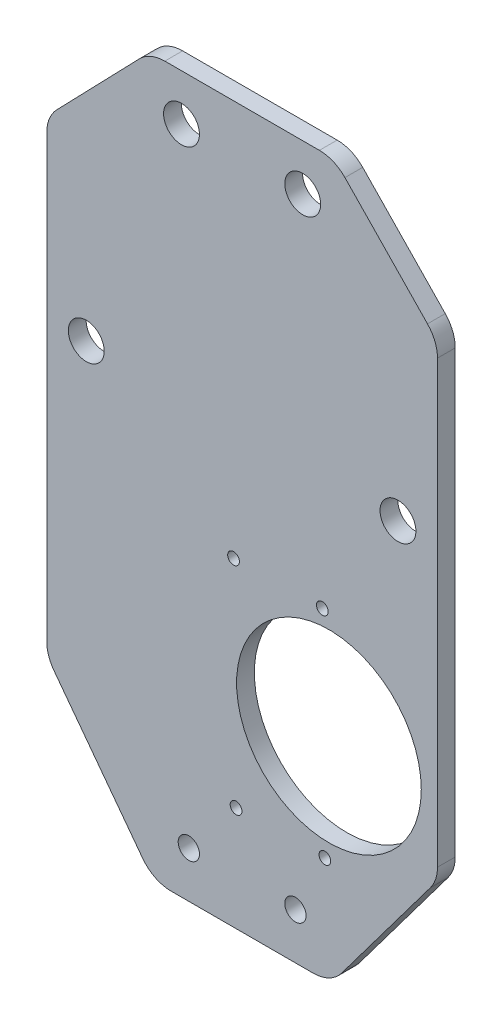
ISO-10303-21;
HEADER;
FILE_DESCRIPTION(('STEP AP214'),'2;1');
FILE_NAME('part.step','',(''),(''),'','','');
FILE_SCHEMA(('AUTOMOTIVE_DESIGN { 1 0 10303 214 1 1 1 1 }'));
ENDSEC;
DATA;
#1=APPLICATION_CONTEXT('core data for automotive mechanical design processes');
#2=APPLICATION_PROTOCOL_DEFINITION('international standard','automotive_design',2000,#1);
#3=PRODUCT_CONTEXT('',#1,'mechanical');
#4=PRODUCT('Part','Part','',(#3));
#5=PRODUCT_RELATED_PRODUCT_CATEGORY('part','',(#4));
#6=PRODUCT_DEFINITION_FORMATION('','',#4);
#7=PRODUCT_DEFINITION_CONTEXT('part definition',#1,'design');
#8=PRODUCT_DEFINITION('design','',#6,#7);
#9=PRODUCT_DEFINITION_SHAPE('','',#8);
#10=(LENGTH_UNIT() NAMED_UNIT(*) SI_UNIT(.MILLI.,.METRE.));
#11=(NAMED_UNIT(*) PLANE_ANGLE_UNIT() SI_UNIT($,.RADIAN.));
#12=(NAMED_UNIT(*) SI_UNIT($,.STERADIAN.) SOLID_ANGLE_UNIT());
#13=UNCERTAINTY_MEASURE_WITH_UNIT(LENGTH_MEASURE(1.E-05),#10,'distance_accuracy_value','');
#14=(GEOMETRIC_REPRESENTATION_CONTEXT(3) GLOBAL_UNCERTAINTY_ASSIGNED_CONTEXT((#13)) GLOBAL_UNIT_ASSIGNED_CONTEXT((#10,
#11,#12)) REPRESENTATION_CONTEXT('',''));
#15=CARTESIAN_POINT('',(0.,0.,0.));
#16=DIRECTION('',(0.,0.,1.));
#17=DIRECTION('',(1.,0.,0.));
#18=AXIS2_PLACEMENT_3D('',#15,#16,#17);
#19=CARTESIAN_POINT('',(0.,0.,5.));
#20=DIRECTION('',(0.,0.,-1.));
#21=DIRECTION('',(-1.,0.,0.));
#22=AXIS2_PLACEMENT_3D('',#19,#20,#21);
#23=PLANE('',#22);
#24=CARTESIAN_POINT('',(-2.41313466629951,89.9378950024155,5.));
#25=DIRECTION('',(0.,0.,-1.));
#26=DIRECTION('',(-1.,0.,0.));
#27=AXIS2_PLACEMENT_3D('',#24,#25,#26);
#28=CIRCLE('',#27,1.65);
#29=CARTESIAN_POINT('',(-4.06313466629951,89.9378950024155,5.));
#30=VERTEX_POINT('',#29);
#31=EDGE_CURVE('E361',#30,#30,#28,.T.);
#32=ORIENTED_EDGE('',*,*,#31,.T.);
#33=EDGE_LOOP('',(#32));
#34=FACE_BOUND('',#33,.T.);
#35=CARTESIAN_POINT('',(22.5851543193509,90.230380540361,5.));
#36=DIRECTION('',(0.,0.,-1.));
#37=DIRECTION('',(-1.,0.,0.));
#38=AXIS2_PLACEMENT_3D('',#35,#36,#37);
#39=CIRCLE('',#38,1.65);
#40=CARTESIAN_POINT('',(20.9351543193509,90.230380540361,5.));
#41=VERTEX_POINT('',#40);
#42=EDGE_CURVE('E355',#41,#41,#39,.T.);
#43=ORIENTED_EDGE('',*,*,#42,.T.);
#44=EDGE_LOOP('',(#43));
#45=FACE_BOUND('',#44,.T.);
#46=CARTESIAN_POINT('',(-1.70531966447117,29.442035657136,5.));
#47=DIRECTION('',(0.,0.,-1.));
#48=DIRECTION('',(-1.,0.,0.));
#49=AXIS2_PLACEMENT_3D('',#46,#47,#48);
#50=CIRCLE('',#49,1.65);
#51=CARTESIAN_POINT('',(-3.35531966447117,29.442035657136,5.));
#52=VERTEX_POINT('',#51);
#53=EDGE_CURVE('E349',#52,#52,#50,.T.);
#54=ORIENTED_EDGE('',*,*,#53,.T.);
#55=EDGE_LOOP('',(#54));
#56=FACE_BOUND('',#55,.T.);
#57=CARTESIAN_POINT('',(23.2929693211793,29.7345211950816,5.));
#58=DIRECTION('',(0.,0.,-1.));
#59=DIRECTION('',(-1.,0.,0.));
#60=AXIS2_PLACEMENT_3D('',#57,#58,#59);
#61=CIRCLE('',#60,1.65);
#62=CARTESIAN_POINT('',(21.6429693211793,29.7345211950816,5.));
#63=VERTEX_POINT('',#62);
#64=EDGE_CURVE('E341',#63,#63,#61,.T.);
#65=ORIENTED_EDGE('',*,*,#64,.T.);
#66=EDGE_LOOP('',(#65));
#67=FACE_BOUND('',#66,.T.);
#68=DIRECTION('',(1.,0.,0.));
#69=VECTOR('',#68,1.);
#70=CARTESIAN_POINT('',(-25.,0.,5.));
#71=LINE('',#70,#69);
#72=CARTESIAN_POINT('',(-20.,0.,5.));
#73=VERTEX_POINT('',#72);
#74=CARTESIAN_POINT('',(20.,0.,5.));
#75=VERTEX_POINT('',#74);
#76=EDGE_CURVE('E286',#73,#75,#71,.T.);
#77=ORIENTED_EDGE('',*,*,#76,.T.);
#78=CARTESIAN_POINT('',(20.,10.,5.));
#79=DIRECTION('',(0.,0.,-1.));
#80=DIRECTION('',(-1.,0.,0.));
#81=AXIS2_PLACEMENT_3D('',#78,#79,#80);
#82=CIRCLE('',#81,10.);
#83=CARTESIAN_POINT('',(28.,4.,5.));
#84=VERTEX_POINT('',#83);
#85=EDGE_CURVE('E231',#75,#84,#82,.F.);
#86=ORIENTED_EDGE('',*,*,#85,.T.);
#87=DIRECTION('',(0.6,0.8,0.));
#88=VECTOR('',#87,1.);
#89=CARTESIAN_POINT('',(25.,0.,5.));
#90=LINE('',#89,#88);
#91=CARTESIAN_POINT('',(53.,37.3333333333333,5.));
#92=VERTEX_POINT('',#91);
#93=EDGE_CURVE('E173',#84,#92,#90,.T.);
#94=ORIENTED_EDGE('',*,*,#93,.T.);
#95=CARTESIAN_POINT('',(45.,43.3333333333333,5.));
#96=DIRECTION('',(0.,0.,-1.));
#97=DIRECTION('',(-1.,0.,0.));
#98=AXIS2_PLACEMENT_3D('',#95,#96,#97);
#99=CIRCLE('',#98,10.);
#100=CARTESIAN_POINT('',(55.,43.3333333333333,5.));
#101=VERTEX_POINT('',#100);
#102=EDGE_CURVE('E229',#92,#101,#99,.F.);
#103=ORIENTED_EDGE('',*,*,#102,.T.);
#104=DIRECTION('',(0.,1.,0.));
#105=VECTOR('',#104,1.);
#106=CARTESIAN_POINT('',(55.,40.,5.));
#107=LINE('',#106,#105);
#108=CARTESIAN_POINT('',(55.,167.456795831017,5.));
#109=VERTEX_POINT('',#108);
#110=EDGE_CURVE('E294',#101,#109,#107,.T.);
#111=ORIENTED_EDGE('',*,*,#110,.T.);
#112=CARTESIAN_POINT('',(45.,167.456795831017,5.));
#113=DIRECTION('',(0.,0.,-1.));
#114=DIRECTION('',(-1.,0.,0.));
#115=AXIS2_PLACEMENT_3D('',#112,#113,#114);
#116=CIRCLE('',#115,10.);
#117=CARTESIAN_POINT('',(52.1898837604911,174.407016799492,5.));
#118=VERTEX_POINT('',#117);
#119=EDGE_CURVE('E218',#109,#118,#116,.F.);
#120=ORIENTED_EDGE('',*,*,#119,.T.);
#121=DIRECTION('',(-0.695022096847475,0.718988376049112,0.));
#122=VECTOR('',#121,1.);
#123=CARTESIAN_POINT('',(55.,171.5,5.));
#124=LINE('',#123,#122);
#125=CARTESIAN_POINT('',(28.9481197304744,198.450220968475,5.));
#126=VERTEX_POINT('',#125);
#127=EDGE_CURVE('E297',#118,#126,#124,.T.);
#128=ORIENTED_EDGE('',*,*,#127,.T.);
#129=CARTESIAN_POINT('',(21.7582359699833,191.5,5.));
#130=DIRECTION('',(0.,0.,-1.));
#131=DIRECTION('',(-1.,0.,0.));
#132=AXIS2_PLACEMENT_3D('',#129,#130,#131);
#133=CIRCLE('',#132,10.);
#134=CARTESIAN_POINT('',(21.7582359699833,201.5,5.));
#135=VERTEX_POINT('',#134);
#136=EDGE_CURVE('E223',#126,#135,#133,.F.);
#137=ORIENTED_EDGE('',*,*,#136,.T.);
#138=DIRECTION('',(-1.,0.,0.));
#139=VECTOR('',#138,1.);
#140=CARTESIAN_POINT('',(-26.,201.5,5.));
#141=LINE('',#140,#139);
#142=CARTESIAN_POINT('',(-21.7582359699833,201.5,5.));
#143=VERTEX_POINT('',#142);
#144=EDGE_CURVE('E268',#135,#143,#141,.T.);
#145=ORIENTED_EDGE('',*,*,#144,.T.);
#146=CARTESIAN_POINT('',(-21.7582359699833,191.5,5.));
#147=DIRECTION('',(0.,0.,-1.));
#148=DIRECTION('',(-1.,0.,0.));
#149=AXIS2_PLACEMENT_3D('',#146,#147,#148);
#150=CIRCLE('',#149,10.);
#151=CARTESIAN_POINT('',(-28.9481197304744,198.450220968475,5.));
#152=VERTEX_POINT('',#151);
#153=EDGE_CURVE('E221',#143,#152,#150,.F.);
#154=ORIENTED_EDGE('',*,*,#153,.T.);
#155=DIRECTION('',(-0.695022096847475,-0.718988376049112,0.));
#156=VECTOR('',#155,1.);
#157=CARTESIAN_POINT('',(-55.,171.5,5.));
#158=LINE('',#157,#156);
#159=CARTESIAN_POINT('',(-52.1898837604911,174.407016799492,5.));
#160=VERTEX_POINT('',#159);
#161=EDGE_CURVE('E260',#152,#160,#158,.T.);
#162=ORIENTED_EDGE('',*,*,#161,.T.);
#163=CARTESIAN_POINT('',(-45.,167.456795831017,5.));
#164=DIRECTION('',(0.,0.,-1.));
#165=DIRECTION('',(-1.,0.,0.));
#166=AXIS2_PLACEMENT_3D('',#163,#164,#165);
#167=CIRCLE('',#166,10.);
#168=CARTESIAN_POINT('',(-55.,167.456795831017,5.));
#169=VERTEX_POINT('',#168);
#170=EDGE_CURVE('E60',#160,#169,#167,.F.);
#171=ORIENTED_EDGE('',*,*,#170,.T.);
#172=DIRECTION('',(0.,-1.,0.));
#173=VECTOR('',#172,1.);
#174=CARTESIAN_POINT('',(-55.,40.,5.));
#175=LINE('',#174,#173);
#176=CARTESIAN_POINT('',(-55.,43.3333333333333,5.));
#177=VERTEX_POINT('',#176);
#178=EDGE_CURVE('E201',#169,#177,#175,.T.);
#179=ORIENTED_EDGE('',*,*,#178,.T.);
#180=CARTESIAN_POINT('',(-45.,43.3333333333333,5.));
#181=DIRECTION('',(0.,0.,-1.));
#182=DIRECTION('',(-1.,0.,0.));
#183=AXIS2_PLACEMENT_3D('',#180,#181,#182);
#184=CIRCLE('',#183,10.);
#185=CARTESIAN_POINT('',(-53.,37.3333333333333,5.));
#186=VERTEX_POINT('',#185);
#187=EDGE_CURVE('E225',#177,#186,#184,.F.);
#188=ORIENTED_EDGE('',*,*,#187,.T.);
#189=DIRECTION('',(0.6,-0.8,0.));
#190=VECTOR('',#189,1.);
#191=CARTESIAN_POINT('',(-25.,0.,5.));
#192=LINE('',#191,#190);
#193=CARTESIAN_POINT('',(-28.,4.,5.));
#194=VERTEX_POINT('',#193);
#195=EDGE_CURVE('E200',#186,#194,#192,.T.);
#196=ORIENTED_EDGE('',*,*,#195,.T.);
#197=CARTESIAN_POINT('',(-20.,10.,5.));
#198=DIRECTION('',(0.,0.,-1.));
#199=DIRECTION('',(-1.,0.,0.));
#200=AXIS2_PLACEMENT_3D('',#197,#198,#199);
#201=CIRCLE('',#200,10.);
#202=EDGE_CURVE('E227',#194,#73,#201,.F.);
#203=ORIENTED_EDGE('',*,*,#202,.T.);
#204=EDGE_LOOP('',(#77,#86,#94,#103,#111,#120,#128,#137,#145,#154,#162,#171,#179,#188,#196,#203));
#205=FACE_BOUND('',#204,.T.);
#206=CARTESIAN_POINT('',(24.4389591594042,60.,5.));
#207=DIRECTION('',(0.,0.,1.));
#208=DIRECTION('',(1.,0.,0.));
#209=AXIS2_PLACEMENT_3D('',#206,#207,#208);
#210=CIRCLE('',#209,26.);
#211=CARTESIAN_POINT('',(50.4389591594041,60.,5.));
#212=VERTEX_POINT('',#211);
#213=EDGE_CURVE('E301',#212,#212,#210,.T.);
#214=ORIENTED_EDGE('',*,*,#213,.F.);
#215=EDGE_LOOP('',(#214));
#216=FACE_BOUND('',#215,.T.);
#217=CARTESIAN_POINT('',(15.,13.,5.));
#218=DIRECTION('',(0.,0.,1.));
#219=DIRECTION('',(1.,0.,0.));
#220=AXIS2_PLACEMENT_3D('',#217,#218,#219);
#221=CIRCLE('',#220,3.);
#222=CARTESIAN_POINT('',(18.,13.,5.));
#223=VERTEX_POINT('',#222);
#224=EDGE_CURVE('E306',#223,#223,#221,.T.);
#225=ORIENTED_EDGE('',*,*,#224,.F.);
#226=EDGE_LOOP('',(#225));
#227=FACE_BOUND('',#226,.T.);
#228=CARTESIAN_POINT('',(-15.,13.,5.));
#229=DIRECTION('',(0.,0.,1.));
#230=DIRECTION('',(-1.,0.,0.));
#231=AXIS2_PLACEMENT_3D('',#228,#229,#230);
#232=CIRCLE('',#231,3.);
#233=CARTESIAN_POINT('',(-18.,13.,5.));
#234=VERTEX_POINT('',#233);
#235=EDGE_CURVE('E311',#234,#234,#232,.T.);
#236=ORIENTED_EDGE('',*,*,#235,.F.);
#237=EDGE_LOOP('',(#236));
#238=FACE_BOUND('',#237,.T.);
#239=CARTESIAN_POINT('',(-17.0625,188.499544235581,5.));
#240=DIRECTION('',(0.,0.,1.));
#241=DIRECTION('',(1.,0.,0.));
#242=AXIS2_PLACEMENT_3D('',#239,#240,#241);
#243=CIRCLE('',#242,5.05);
#244=CARTESIAN_POINT('',(-12.0125,188.499544235581,5.));
#245=VERTEX_POINT('',#244);
#246=EDGE_CURVE('E317',#245,#245,#243,.T.);
#247=ORIENTED_EDGE('',*,*,#246,.F.);
#248=EDGE_LOOP('',(#247));
#249=FACE_BOUND('',#248,.T.);
#250=CARTESIAN_POINT('',(17.0625,188.499544235581,5.));
#251=DIRECTION('',(0.,0.,1.));
#252=DIRECTION('',(1.,0.,0.));
#253=AXIS2_PLACEMENT_3D('',#250,#251,#252);
#254=CIRCLE('',#253,5.05);
#255=CARTESIAN_POINT('',(22.1125,188.499544235581,5.));
#256=VERTEX_POINT('',#255);
#257=EDGE_CURVE('E323',#256,#256,#254,.T.);
#258=ORIENTED_EDGE('',*,*,#257,.F.);
#259=EDGE_LOOP('',(#258));
#260=FACE_BOUND('',#259,.T.);
#261=CARTESIAN_POINT('',(-43.875,122.217270257164,5.));
#262=DIRECTION('',(0.,0.,1.));
#263=DIRECTION('',(1.,0.,0.));
#264=AXIS2_PLACEMENT_3D('',#261,#262,#263);
#265=CIRCLE('',#264,5.05);
#266=CARTESIAN_POINT('',(-38.825,122.217270257164,5.));
#267=VERTEX_POINT('',#266);
#268=EDGE_CURVE('E329',#267,#267,#265,.T.);
#269=ORIENTED_EDGE('',*,*,#268,.F.);
#270=EDGE_LOOP('',(#269));
#271=FACE_BOUND('',#270,.T.);
#272=CARTESIAN_POINT('',(43.875,122.217270257164,5.));
#273=DIRECTION('',(0.,0.,1.));
#274=DIRECTION('',(1.,0.,0.));
#275=AXIS2_PLACEMENT_3D('',#272,#273,#274);
#276=CIRCLE('',#275,5.05);
#277=CARTESIAN_POINT('',(48.925,122.217270257164,5.));
#278=VERTEX_POINT('',#277);
#279=EDGE_CURVE('E335',#278,#278,#276,.T.);
#280=ORIENTED_EDGE('',*,*,#279,.F.);
#281=EDGE_LOOP('',(#280));
#282=FACE_BOUND('',#281,.T.);
#283=ADVANCED_FACE('F38',(#34,#45,#56,#67,#205,#216,#227,#238,#249,#260,#271,#282),#23,.F.);
#284=CARTESIAN_POINT('',(0.,0.,0.));
#285=DIRECTION('',(0.,0.,-1.));
#286=DIRECTION('',(-1.,0.,0.));
#287=AXIS2_PLACEMENT_3D('',#284,#285,#286);
#288=PLANE('',#287);
#289=CARTESIAN_POINT('',(-2.41313466629951,89.9378950024155,0.));
#290=DIRECTION('',(0.,0.,-1.));
#291=DIRECTION('',(-1.,0.,0.));
#292=AXIS2_PLACEMENT_3D('',#289,#290,#291);
#293=CIRCLE('',#292,1.65);
#294=CARTESIAN_POINT('',(-4.06313466629951,89.9378950024155,0.));
#295=VERTEX_POINT('',#294);
#296=EDGE_CURVE('E364',#295,#295,#293,.T.);
#297=ORIENTED_EDGE('',*,*,#296,.F.);
#298=EDGE_LOOP('',(#297));
#299=FACE_BOUND('',#298,.T.);
#300=CARTESIAN_POINT('',(22.5851543193509,90.230380540361,0.));
#301=DIRECTION('',(0.,0.,-1.));
#302=DIRECTION('',(-1.,0.,0.));
#303=AXIS2_PLACEMENT_3D('',#300,#301,#302);
#304=CIRCLE('',#303,1.65);
#305=CARTESIAN_POINT('',(20.9351543193509,90.230380540361,0.));
#306=VERTEX_POINT('',#305);
#307=EDGE_CURVE('E358',#306,#306,#304,.T.);
#308=ORIENTED_EDGE('',*,*,#307,.F.);
#309=EDGE_LOOP('',(#308));
#310=FACE_BOUND('',#309,.T.);
#311=CARTESIAN_POINT('',(-1.70531966447117,29.442035657136,0.));
#312=DIRECTION('',(0.,0.,-1.));
#313=DIRECTION('',(-1.,0.,0.));
#314=AXIS2_PLACEMENT_3D('',#311,#312,#313);
#315=CIRCLE('',#314,1.65);
#316=CARTESIAN_POINT('',(-3.35531966447117,29.442035657136,0.));
#317=VERTEX_POINT('',#316);
#318=EDGE_CURVE('E352',#317,#317,#315,.T.);
#319=ORIENTED_EDGE('',*,*,#318,.F.);
#320=EDGE_LOOP('',(#319));
#321=FACE_BOUND('',#320,.T.);
#322=CARTESIAN_POINT('',(23.2929693211793,29.7345211950816,0.));
#323=DIRECTION('',(0.,0.,-1.));
#324=DIRECTION('',(-1.,0.,0.));
#325=AXIS2_PLACEMENT_3D('',#322,#323,#324);
#326=CIRCLE('',#325,1.65);
#327=CARTESIAN_POINT('',(21.6429693211793,29.7345211950816,0.));
#328=VERTEX_POINT('',#327);
#329=EDGE_CURVE('E346',#328,#328,#326,.T.);
#330=ORIENTED_EDGE('',*,*,#329,.F.);
#331=EDGE_LOOP('',(#330));
#332=FACE_BOUND('',#331,.T.);
#333=CARTESIAN_POINT('',(-43.875,122.217270257164,0.));
#334=DIRECTION('',(0.,0.,1.));
#335=DIRECTION('',(1.,0.,0.));
#336=AXIS2_PLACEMENT_3D('',#333,#334,#335);
#337=CIRCLE('',#336,5.05);
#338=CARTESIAN_POINT('',(-38.825,122.217270257164,0.));
#339=VERTEX_POINT('',#338);
#340=EDGE_CURVE('E332',#339,#339,#337,.T.);
#341=ORIENTED_EDGE('',*,*,#340,.T.);
#342=EDGE_LOOP('',(#341));
#343=FACE_BOUND('',#342,.T.);
#344=CARTESIAN_POINT('',(-17.0625,188.499544235581,0.));
#345=DIRECTION('',(0.,0.,1.));
#346=DIRECTION('',(1.,0.,0.));
#347=AXIS2_PLACEMENT_3D('',#344,#345,#346);
#348=CIRCLE('',#347,5.05);
#349=CARTESIAN_POINT('',(-12.0125,188.499544235581,0.));
#350=VERTEX_POINT('',#349);
#351=EDGE_CURVE('E320',#350,#350,#348,.T.);
#352=ORIENTED_EDGE('',*,*,#351,.T.);
#353=EDGE_LOOP('',(#352));
#354=FACE_BOUND('',#353,.T.);
#355=CARTESIAN_POINT('',(15.,13.,0.));
#356=DIRECTION('',(0.,0.,1.));
#357=DIRECTION('',(1.,0.,0.));
#358=AXIS2_PLACEMENT_3D('',#355,#356,#357);
#359=CIRCLE('',#358,3.);
#360=CARTESIAN_POINT('',(18.,13.,0.));
#361=VERTEX_POINT('',#360);
#362=EDGE_CURVE('E308',#361,#361,#359,.T.);
#363=ORIENTED_EDGE('',*,*,#362,.T.);
#364=EDGE_LOOP('',(#363));
#365=FACE_BOUND('',#364,.T.);
#366=DIRECTION('',(0.6,0.8,0.));
#367=VECTOR('',#366,1.);
#368=CARTESIAN_POINT('',(25.,0.,0.));
#369=LINE('',#368,#367);
#370=CARTESIAN_POINT('',(28.,4.,0.));
#371=VERTEX_POINT('',#370);
#372=CARTESIAN_POINT('',(53.,37.3333333333333,0.));
#373=VERTEX_POINT('',#372);
#374=EDGE_CURVE('E170',#371,#373,#369,.T.);
#375=ORIENTED_EDGE('',*,*,#374,.F.);
#376=CARTESIAN_POINT('',(20.,10.,0.));
#377=DIRECTION('',(0.,0.,-1.));
#378=DIRECTION('',(-1.,0.,0.));
#379=AXIS2_PLACEMENT_3D('',#376,#377,#378);
#380=CIRCLE('',#379,10.);
#381=CARTESIAN_POINT('',(20.,0.,0.));
#382=VERTEX_POINT('',#381);
#383=EDGE_CURVE('E153',#371,#382,#380,.T.);
#384=ORIENTED_EDGE('',*,*,#383,.T.);
#385=DIRECTION('',(1.,0.,0.));
#386=VECTOR('',#385,1.);
#387=CARTESIAN_POINT('',(-25.,0.,0.));
#388=LINE('',#387,#386);
#389=CARTESIAN_POINT('',(-20.,0.,0.));
#390=VERTEX_POINT('',#389);
#391=EDGE_CURVE('E181',#390,#382,#388,.T.);
#392=ORIENTED_EDGE('',*,*,#391,.F.);
#393=CARTESIAN_POINT('',(-20.,10.,0.));
#394=DIRECTION('',(0.,0.,-1.));
#395=DIRECTION('',(-1.,0.,0.));
#396=AXIS2_PLACEMENT_3D('',#393,#394,#395);
#397=CIRCLE('',#396,10.);
#398=CARTESIAN_POINT('',(-28.,4.,0.));
#399=VERTEX_POINT('',#398);
#400=EDGE_CURVE('E212',#390,#399,#397,.T.);
#401=ORIENTED_EDGE('',*,*,#400,.T.);
#402=DIRECTION('',(0.6,-0.8,0.));
#403=VECTOR('',#402,1.);
#404=CARTESIAN_POINT('',(-25.,0.,0.));
#405=LINE('',#404,#403);
#406=CARTESIAN_POINT('',(-53.,37.3333333333333,0.));
#407=VERTEX_POINT('',#406);
#408=EDGE_CURVE('E186',#407,#399,#405,.T.);
#409=ORIENTED_EDGE('',*,*,#408,.F.);
#410=CARTESIAN_POINT('',(-45.,43.3333333333333,0.));
#411=DIRECTION('',(0.,0.,-1.));
#412=DIRECTION('',(-1.,0.,0.));
#413=AXIS2_PLACEMENT_3D('',#410,#411,#412);
#414=CIRCLE('',#413,10.);
#415=CARTESIAN_POINT('',(-55.,43.3333333333333,0.));
#416=VERTEX_POINT('',#415);
#417=EDGE_CURVE('E210',#407,#416,#414,.T.);
#418=ORIENTED_EDGE('',*,*,#417,.T.);
#419=DIRECTION('',(0.,-1.,0.));
#420=VECTOR('',#419,1.);
#421=CARTESIAN_POINT('',(-55.,40.,0.));
#422=LINE('',#421,#420);
#423=CARTESIAN_POINT('',(-55.,167.456795831017,0.));
#424=VERTEX_POINT('',#423);
#425=EDGE_CURVE('E198',#424,#416,#422,.T.);
#426=ORIENTED_EDGE('',*,*,#425,.F.);
#427=CARTESIAN_POINT('',(-45.,167.456795831017,0.));
#428=DIRECTION('',(0.,0.,-1.));
#429=DIRECTION('',(-1.,0.,0.));
#430=AXIS2_PLACEMENT_3D('',#427,#428,#429);
#431=CIRCLE('',#430,10.);
#432=CARTESIAN_POINT('',(-52.1898837604911,174.407016799492,0.));
#433=VERTEX_POINT('',#432);
#434=EDGE_CURVE('E204',#424,#433,#431,.T.);
#435=ORIENTED_EDGE('',*,*,#434,.T.);
#436=DIRECTION('',(-0.695022096847475,-0.718988376049112,0.));
#437=VECTOR('',#436,1.);
#438=CARTESIAN_POINT('',(-55.,171.5,0.));
#439=LINE('',#438,#437);
#440=CARTESIAN_POINT('',(-28.9481197304744,198.450220968475,0.));
#441=VERTEX_POINT('',#440);
#442=EDGE_CURVE('E195',#441,#433,#439,.T.);
#443=ORIENTED_EDGE('',*,*,#442,.F.);
#444=CARTESIAN_POINT('',(-21.7582359699833,191.5,0.));
#445=DIRECTION('',(0.,0.,-1.));
#446=DIRECTION('',(-1.,0.,0.));
#447=AXIS2_PLACEMENT_3D('',#444,#445,#446);
#448=CIRCLE('',#447,10.);
#449=CARTESIAN_POINT('',(-21.7582359699833,201.5,0.));
#450=VERTEX_POINT('',#449);
#451=EDGE_CURVE('E206',#441,#450,#448,.T.);
#452=ORIENTED_EDGE('',*,*,#451,.T.);
#453=DIRECTION('',(-1.,0.,0.));
#454=VECTOR('',#453,1.);
#455=CARTESIAN_POINT('',(-26.,201.5,0.));
#456=LINE('',#455,#454);
#457=CARTESIAN_POINT('',(21.7582359699833,201.5,0.));
#458=VERTEX_POINT('',#457);
#459=EDGE_CURVE('E192',#458,#450,#456,.T.);
#460=ORIENTED_EDGE('',*,*,#459,.F.);
#461=CARTESIAN_POINT('',(21.7582359699833,191.5,0.));
#462=DIRECTION('',(0.,0.,-1.));
#463=DIRECTION('',(-1.,0.,0.));
#464=AXIS2_PLACEMENT_3D('',#461,#462,#463);
#465=CIRCLE('',#464,10.);
#466=CARTESIAN_POINT('',(28.9481197304744,198.450220968475,0.));
#467=VERTEX_POINT('',#466);
#468=EDGE_CURVE('E208',#458,#467,#465,.T.);
#469=ORIENTED_EDGE('',*,*,#468,.T.);
#470=DIRECTION('',(-0.695022096847475,0.718988376049112,0.));
#471=VECTOR('',#470,1.);
#472=CARTESIAN_POINT('',(55.,171.5,0.));
#473=LINE('',#472,#471);
#474=CARTESIAN_POINT('',(52.1898837604911,174.407016799492,0.));
#475=VERTEX_POINT('',#474);
#476=EDGE_CURVE('E184',#475,#467,#473,.T.);
#477=ORIENTED_EDGE('',*,*,#476,.F.);
#478=CARTESIAN_POINT('',(45.,167.456795831017,0.));
#479=DIRECTION('',(0.,0.,-1.));
#480=DIRECTION('',(-1.,0.,0.));
#481=AXIS2_PLACEMENT_3D('',#478,#479,#480);
#482=CIRCLE('',#481,10.);
#483=CARTESIAN_POINT('',(55.,167.456795831017,0.));
#484=VERTEX_POINT('',#483);
#485=EDGE_CURVE('E174',#475,#484,#482,.T.);
#486=ORIENTED_EDGE('',*,*,#485,.T.);
#487=DIRECTION('',(0.,1.,0.));
#488=VECTOR('',#487,1.);
#489=CARTESIAN_POINT('',(55.,40.,0.));
#490=LINE('',#489,#488);
#491=CARTESIAN_POINT('',(55.,43.3333333333333,0.));
#492=VERTEX_POINT('',#491);
#493=EDGE_CURVE('E180',#492,#484,#490,.T.);
#494=ORIENTED_EDGE('',*,*,#493,.F.);
#495=CARTESIAN_POINT('',(45.,43.3333333333333,0.));
#496=DIRECTION('',(0.,0.,-1.));
#497=DIRECTION('',(-1.,0.,0.));
#498=AXIS2_PLACEMENT_3D('',#495,#496,#497);
#499=CIRCLE('',#498,10.);
#500=EDGE_CURVE('E164',#492,#373,#499,.T.);
#501=ORIENTED_EDGE('',*,*,#500,.T.);
#502=EDGE_LOOP('',(#375,#384,#392,#401,#409,#418,#426,#435,#443,#452,#460,#469,#477,#486,#494,#501));
#503=FACE_BOUND('',#502,.T.);
#504=CARTESIAN_POINT('',(24.4389591594042,60.,0.));
#505=DIRECTION('',(0.,0.,1.));
#506=DIRECTION('',(1.,0.,0.));
#507=AXIS2_PLACEMENT_3D('',#504,#505,#506);
#508=CIRCLE('',#507,26.);
#509=CARTESIAN_POINT('',(50.4389591594041,60.,0.));
#510=VERTEX_POINT('',#509);
#511=EDGE_CURVE('E290',#510,#510,#508,.T.);
#512=ORIENTED_EDGE('',*,*,#511,.T.);
#513=EDGE_LOOP('',(#512));
#514=FACE_BOUND('',#513,.T.);
#515=CARTESIAN_POINT('',(-15.,13.,0.));
#516=DIRECTION('',(0.,0.,1.));
#517=DIRECTION('',(-1.,0.,0.));
#518=AXIS2_PLACEMENT_3D('',#515,#516,#517);
#519=CIRCLE('',#518,3.);
#520=CARTESIAN_POINT('',(-18.,13.,0.));
#521=VERTEX_POINT('',#520);
#522=EDGE_CURVE('E314',#521,#521,#519,.T.);
#523=ORIENTED_EDGE('',*,*,#522,.T.);
#524=EDGE_LOOP('',(#523));
#525=FACE_BOUND('',#524,.T.);
#526=CARTESIAN_POINT('',(17.0625,188.499544235581,0.));
#527=DIRECTION('',(0.,0.,1.));
#528=DIRECTION('',(1.,0.,0.));
#529=AXIS2_PLACEMENT_3D('',#526,#527,#528);
#530=CIRCLE('',#529,5.05);
#531=CARTESIAN_POINT('',(22.1125,188.499544235581,0.));
#532=VERTEX_POINT('',#531);
#533=EDGE_CURVE('E326',#532,#532,#530,.T.);
#534=ORIENTED_EDGE('',*,*,#533,.T.);
#535=EDGE_LOOP('',(#534));
#536=FACE_BOUND('',#535,.T.);
#537=CARTESIAN_POINT('',(43.875,122.217270257164,0.));
#538=DIRECTION('',(0.,0.,1.));
#539=DIRECTION('',(1.,0.,0.));
#540=AXIS2_PLACEMENT_3D('',#537,#538,#539);
#541=CIRCLE('',#540,5.05);
#542=CARTESIAN_POINT('',(48.925,122.217270257164,0.));
#543=VERTEX_POINT('',#542);
#544=EDGE_CURVE('E338',#543,#543,#541,.T.);
#545=ORIENTED_EDGE('',*,*,#544,.T.);
#546=EDGE_LOOP('',(#545));
#547=FACE_BOUND('',#546,.T.);
#548=ADVANCED_FACE('F177',(#299,#310,#321,#332,#343,#354,#365,#503,#514,#525,#536,#547),#288,.T.);
#549=CARTESIAN_POINT('',(-25.,0.,5.));
#550=DIRECTION('',(0.8,0.6,0.));
#551=DIRECTION('',(-0.6,0.8,0.));
#552=AXIS2_PLACEMENT_3D('',#549,#550,#551);
#553=PLANE('',#552);
#554=ORIENTED_EDGE('',*,*,#408,.T.);
#555=DIRECTION('',(0.,0.,-1.));
#556=VECTOR('',#555,1.);
#557=CARTESIAN_POINT('',(-28.,4.,5.));
#558=LINE('',#557,#556);
#559=EDGE_CURVE('E241',#399,#194,#558,.F.);
#560=ORIENTED_EDGE('',*,*,#559,.T.);
#561=ORIENTED_EDGE('',*,*,#195,.F.);
#562=DIRECTION('',(0.,0.,-1.));
#563=VECTOR('',#562,1.);
#564=CARTESIAN_POINT('',(-53.,37.3333333333333,5.));
#565=LINE('',#564,#563);
#566=EDGE_CURVE('E238',#186,#407,#565,.T.);
#567=ORIENTED_EDGE('',*,*,#566,.T.);
#568=EDGE_LOOP('',(#554,#560,#561,#567));
#569=FACE_BOUND('',#568,.T.);
#570=ADVANCED_FACE('F282',(#569),#553,.F.);
#571=CARTESIAN_POINT('',(-25.,0.,5.));
#572=DIRECTION('',(0.,1.,0.));
#573=DIRECTION('',(0.,0.,1.));
#574=AXIS2_PLACEMENT_3D('',#571,#572,#573);
#575=PLANE('',#574);
#576=ORIENTED_EDGE('',*,*,#391,.T.);
#577=DIRECTION('',(0.,0.,-1.));
#578=VECTOR('',#577,1.);
#579=CARTESIAN_POINT('',(20.,0.,5.));
#580=LINE('',#579,#578);
#581=EDGE_CURVE('E158',#382,#75,#580,.F.);
#582=ORIENTED_EDGE('',*,*,#581,.T.);
#583=ORIENTED_EDGE('',*,*,#76,.F.);
#584=DIRECTION('',(0.,0.,-1.));
#585=VECTOR('',#584,1.);
#586=CARTESIAN_POINT('',(-20.,0.,5.));
#587=LINE('',#586,#585);
#588=EDGE_CURVE('E163',#73,#390,#587,.T.);
#589=ORIENTED_EDGE('',*,*,#588,.T.);
#590=EDGE_LOOP('',(#576,#582,#583,#589));
#591=FACE_BOUND('',#590,.T.);
#592=ADVANCED_FACE('F425',(#591),#575,.F.);
#593=CARTESIAN_POINT('',(25.,0.,5.));
#594=DIRECTION('',(-0.8,0.6,0.));
#595=DIRECTION('',(-0.6,-0.8,0.));
#596=AXIS2_PLACEMENT_3D('',#593,#594,#595);
#597=PLANE('',#596);
#598=ORIENTED_EDGE('',*,*,#93,.F.);
#599=DIRECTION('',(0.,0.,-1.));
#600=VECTOR('',#599,1.);
#601=CARTESIAN_POINT('',(28.,4.,5.));
#602=LINE('',#601,#600);
#603=EDGE_CURVE('E157',#84,#371,#602,.T.);
#604=ORIENTED_EDGE('',*,*,#603,.T.);
#605=ORIENTED_EDGE('',*,*,#374,.T.);
#606=DIRECTION('',(0.,0.,-1.));
#607=VECTOR('',#606,1.);
#608=CARTESIAN_POINT('',(53.,37.3333333333333,5.));
#609=LINE('',#608,#607);
#610=EDGE_CURVE('E175',#373,#92,#609,.F.);
#611=ORIENTED_EDGE('',*,*,#610,.T.);
#612=EDGE_LOOP('',(#598,#604,#605,#611));
#613=FACE_BOUND('',#612,.T.);
#614=ADVANCED_FACE('F169',(#613),#597,.F.);
#615=CARTESIAN_POINT('',(55.,40.,5.));
#616=DIRECTION('',(-1.,0.,0.));
#617=DIRECTION('',(0.,-1.,0.));
#618=AXIS2_PLACEMENT_3D('',#615,#616,#617);
#619=PLANE('',#618);
#620=ORIENTED_EDGE('',*,*,#110,.F.);
#621=DIRECTION('',(0.,0.,-1.));
#622=VECTOR('',#621,1.);
#623=CARTESIAN_POINT('',(55.,43.3333333333333,5.));
#624=LINE('',#623,#622);
#625=EDGE_CURVE('E235',#101,#492,#624,.T.);
#626=ORIENTED_EDGE('',*,*,#625,.T.);
#627=ORIENTED_EDGE('',*,*,#493,.T.);
#628=DIRECTION('',(0.,0.,-1.));
#629=VECTOR('',#628,1.);
#630=CARTESIAN_POINT('',(55.,167.456795831017,5.));
#631=LINE('',#630,#629);
#632=EDGE_CURVE('E233',#484,#109,#631,.F.);
#633=ORIENTED_EDGE('',*,*,#632,.T.);
#634=EDGE_LOOP('',(#620,#626,#627,#633));
#635=FACE_BOUND('',#634,.T.);
#636=ADVANCED_FACE('F418',(#635),#619,.F.);
#637=CARTESIAN_POINT('',(55.,171.5,5.));
#638=DIRECTION('',(-0.718988376049112,-0.695022096847475,0.));
#639=DIRECTION('',(0.695022096847475,-0.718988376049112,0.));
#640=AXIS2_PLACEMENT_3D('',#637,#638,#639);
#641=PLANE('',#640);
#642=ORIENTED_EDGE('',*,*,#476,.T.);
#643=DIRECTION('',(0.,0.,-1.));
#644=VECTOR('',#643,1.);
#645=CARTESIAN_POINT('',(28.9481197304744,198.450220968475,5.));
#646=LINE('',#645,#644);
#647=EDGE_CURVE('E255',#467,#126,#646,.F.);
#648=ORIENTED_EDGE('',*,*,#647,.T.);
#649=ORIENTED_EDGE('',*,*,#127,.F.);
#650=DIRECTION('',(0.,0.,-1.));
#651=VECTOR('',#650,1.);
#652=CARTESIAN_POINT('',(52.1898837604911,174.407016799492,5.));
#653=LINE('',#652,#651);
#654=EDGE_CURVE('E252',#118,#475,#653,.T.);
#655=ORIENTED_EDGE('',*,*,#654,.T.);
#656=EDGE_LOOP('',(#642,#648,#649,#655));
#657=FACE_BOUND('',#656,.T.);
#658=ADVANCED_FACE('F414',(#657),#641,.F.);
#659=CARTESIAN_POINT('',(-26.,201.5,5.));
#660=DIRECTION('',(0.,-1.,0.));
#661=DIRECTION('',(0.,0.,-1.));
#662=AXIS2_PLACEMENT_3D('',#659,#660,#661);
#663=PLANE('',#662);
#664=ORIENTED_EDGE('',*,*,#144,.F.);
#665=DIRECTION('',(0.,0.,-1.));
#666=VECTOR('',#665,1.);
#667=CARTESIAN_POINT('',(21.7582359699833,201.5,5.));
#668=LINE('',#667,#666);
#669=EDGE_CURVE('E249',#135,#458,#668,.T.);
#670=ORIENTED_EDGE('',*,*,#669,.T.);
#671=ORIENTED_EDGE('',*,*,#459,.T.);
#672=DIRECTION('',(0.,0.,-1.));
#673=VECTOR('',#672,1.);
#674=CARTESIAN_POINT('',(-21.7582359699833,201.5,5.));
#675=LINE('',#674,#673);
#676=EDGE_CURVE('E247',#450,#143,#675,.F.);
#677=ORIENTED_EDGE('',*,*,#676,.T.);
#678=EDGE_LOOP('',(#664,#670,#671,#677));
#679=FACE_BOUND('',#678,.T.);
#680=ADVANCED_FACE('F411',(#679),#663,.F.);
#681=CARTESIAN_POINT('',(-55.,171.5,5.));
#682=DIRECTION('',(0.718988376049112,-0.695022096847475,0.));
#683=DIRECTION('',(0.695022096847475,0.718988376049112,0.));
#684=AXIS2_PLACEMENT_3D('',#681,#682,#683);
#685=PLANE('',#684);
#686=ORIENTED_EDGE('',*,*,#161,.F.);
#687=DIRECTION('',(0.,0.,-1.));
#688=VECTOR('',#687,1.);
#689=CARTESIAN_POINT('',(-28.9481197304744,198.450220968475,5.));
#690=LINE('',#689,#688);
#691=EDGE_CURVE('E11',#152,#441,#690,.T.);
#692=ORIENTED_EDGE('',*,*,#691,.T.);
#693=ORIENTED_EDGE('',*,*,#442,.T.);
#694=DIRECTION('',(0.,0.,-1.));
#695=VECTOR('',#694,1.);
#696=CARTESIAN_POINT('',(-52.1898837604911,174.407016799492,5.));
#697=LINE('',#696,#695);
#698=EDGE_CURVE('E46',#433,#160,#697,.F.);
#699=ORIENTED_EDGE('',*,*,#698,.T.);
#700=EDGE_LOOP('',(#686,#692,#693,#699));
#701=FACE_BOUND('',#700,.T.);
#702=ADVANCED_FACE('F259',(#701),#685,.F.);
#703=CARTESIAN_POINT('',(-55.,40.,5.));
#704=DIRECTION('',(1.,0.,0.));
#705=DIRECTION('',(0.,1.,0.));
#706=AXIS2_PLACEMENT_3D('',#703,#704,#705);
#707=PLANE('',#706);
#708=ORIENTED_EDGE('',*,*,#425,.T.);
#709=DIRECTION('',(0.,0.,-1.));
#710=VECTOR('',#709,1.);
#711=CARTESIAN_POINT('',(-55.,43.3333333333333,5.));
#712=LINE('',#711,#710);
#713=EDGE_CURVE('E53',#416,#177,#712,.F.);
#714=ORIENTED_EDGE('',*,*,#713,.T.);
#715=ORIENTED_EDGE('',*,*,#178,.F.);
#716=DIRECTION('',(0.,0.,-1.));
#717=VECTOR('',#716,1.);
#718=CARTESIAN_POINT('',(-55.,167.456795831017,5.));
#719=LINE('',#718,#717);
#720=EDGE_CURVE('E243',#169,#424,#719,.T.);
#721=ORIENTED_EDGE('',*,*,#720,.T.);
#722=EDGE_LOOP('',(#708,#714,#715,#721));
#723=FACE_BOUND('',#722,.T.);
#724=ADVANCED_FACE('F273',(#723),#707,.F.);
#725=CARTESIAN_POINT('',(24.4389591594042,60.,5.));
#726=DIRECTION('',(0.,0.,-1.));
#727=DIRECTION('',(-1.,0.,0.));
#728=AXIS2_PLACEMENT_3D('',#725,#726,#727);
#729=CYLINDRICAL_SURFACE('',#728,26.);
#730=ORIENTED_EDGE('',*,*,#213,.T.);
#731=EDGE_LOOP('',(#730));
#732=FACE_BOUND('',#731,.T.);
#733=ORIENTED_EDGE('',*,*,#511,.F.);
#734=EDGE_LOOP('',(#733));
#735=FACE_BOUND('',#734,.T.);
#736=ADVANCED_FACE('F389',(#732,#735),#729,.F.);
#737=CARTESIAN_POINT('',(15.,13.,5.));
#738=DIRECTION('',(0.,0.,-1.));
#739=DIRECTION('',(-1.,0.,0.));
#740=AXIS2_PLACEMENT_3D('',#737,#738,#739);
#741=CYLINDRICAL_SURFACE('',#740,3.);
#742=ORIENTED_EDGE('',*,*,#224,.T.);
#743=EDGE_LOOP('',(#742));
#744=FACE_BOUND('',#743,.T.);
#745=ORIENTED_EDGE('',*,*,#362,.F.);
#746=EDGE_LOOP('',(#745));
#747=FACE_BOUND('',#746,.T.);
#748=ADVANCED_FACE('F386',(#744,#747),#741,.F.);
#749=CARTESIAN_POINT('',(-15.,13.,5.));
#750=DIRECTION('',(0.,0.,-1.));
#751=DIRECTION('',(-1.,0.,0.));
#752=AXIS2_PLACEMENT_3D('',#749,#750,#751);
#753=CYLINDRICAL_SURFACE('',#752,3.);
#754=ORIENTED_EDGE('',*,*,#235,.T.);
#755=EDGE_LOOP('',(#754));
#756=FACE_BOUND('',#755,.T.);
#757=ORIENTED_EDGE('',*,*,#522,.F.);
#758=EDGE_LOOP('',(#757));
#759=FACE_BOUND('',#758,.T.);
#760=ADVANCED_FACE('F388',(#756,#759),#753,.F.);
#761=CARTESIAN_POINT('',(-17.0625,188.499544235581,5.));
#762=DIRECTION('',(0.,0.,-1.));
#763=DIRECTION('',(-1.,0.,0.));
#764=AXIS2_PLACEMENT_3D('',#761,#762,#763);
#765=CYLINDRICAL_SURFACE('',#764,5.05);
#766=ORIENTED_EDGE('',*,*,#246,.T.);
#767=EDGE_LOOP('',(#766));
#768=FACE_BOUND('',#767,.T.);
#769=ORIENTED_EDGE('',*,*,#351,.F.);
#770=EDGE_LOOP('',(#769));
#771=FACE_BOUND('',#770,.T.);
#772=ADVANCED_FACE('F396',(#768,#771),#765,.F.);
#773=CARTESIAN_POINT('',(17.0625,188.499544235581,5.));
#774=DIRECTION('',(0.,0.,-1.));
#775=DIRECTION('',(-1.,0.,0.));
#776=AXIS2_PLACEMENT_3D('',#773,#774,#775);
#777=CYLINDRICAL_SURFACE('',#776,5.05);
#778=ORIENTED_EDGE('',*,*,#257,.T.);
#779=EDGE_LOOP('',(#778));
#780=FACE_BOUND('',#779,.T.);
#781=ORIENTED_EDGE('',*,*,#533,.F.);
#782=EDGE_LOOP('',(#781));
#783=FACE_BOUND('',#782,.T.);
#784=ADVANCED_FACE('F494',(#780,#783),#777,.F.);
#785=CARTESIAN_POINT('',(-43.875,122.217270257164,5.));
#786=DIRECTION('',(0.,0.,-1.));
#787=DIRECTION('',(-1.,0.,0.));
#788=AXIS2_PLACEMENT_3D('',#785,#786,#787);
#789=CYLINDRICAL_SURFACE('',#788,5.05);
#790=ORIENTED_EDGE('',*,*,#268,.T.);
#791=EDGE_LOOP('',(#790));
#792=FACE_BOUND('',#791,.T.);
#793=ORIENTED_EDGE('',*,*,#340,.F.);
#794=EDGE_LOOP('',(#793));
#795=FACE_BOUND('',#794,.T.);
#796=ADVANCED_FACE('F490',(#792,#795),#789,.F.);
#797=CARTESIAN_POINT('',(43.875,122.217270257164,5.));
#798=DIRECTION('',(0.,0.,-1.));
#799=DIRECTION('',(-1.,0.,0.));
#800=AXIS2_PLACEMENT_3D('',#797,#798,#799);
#801=CYLINDRICAL_SURFACE('',#800,5.05);
#802=ORIENTED_EDGE('',*,*,#279,.T.);
#803=EDGE_LOOP('',(#802));
#804=FACE_BOUND('',#803,.T.);
#805=ORIENTED_EDGE('',*,*,#544,.F.);
#806=EDGE_LOOP('',(#805));
#807=FACE_BOUND('',#806,.T.);
#808=ADVANCED_FACE('F434',(#804,#807),#801,.F.);
#809=CARTESIAN_POINT('',(20.,10.,5.));
#810=DIRECTION('',(0.,0.,-1.));
#811=DIRECTION('',(-1.,0.,0.));
#812=AXIS2_PLACEMENT_3D('',#809,#810,#811);
#813=CYLINDRICAL_SURFACE('',#812,10.);
#814=ORIENTED_EDGE('',*,*,#85,.F.);
#815=ORIENTED_EDGE('',*,*,#581,.F.);
#816=ORIENTED_EDGE('',*,*,#383,.F.);
#817=ORIENTED_EDGE('',*,*,#603,.F.);
#818=EDGE_LOOP('',(#814,#815,#816,#817));
#819=FACE_BOUND('',#818,.T.);
#820=ADVANCED_FACE('F156',(#819),#813,.T.);
#821=CARTESIAN_POINT('',(45.,43.3333333333333,5.));
#822=DIRECTION('',(0.,0.,-1.));
#823=DIRECTION('',(-1.,0.,0.));
#824=AXIS2_PLACEMENT_3D('',#821,#822,#823);
#825=CYLINDRICAL_SURFACE('',#824,10.);
#826=ORIENTED_EDGE('',*,*,#102,.F.);
#827=ORIENTED_EDGE('',*,*,#610,.F.);
#828=ORIENTED_EDGE('',*,*,#500,.F.);
#829=ORIENTED_EDGE('',*,*,#625,.F.);
#830=EDGE_LOOP('',(#826,#827,#828,#829));
#831=FACE_BOUND('',#830,.T.);
#832=ADVANCED_FACE('F433',(#831),#825,.T.);
#833=CARTESIAN_POINT('',(-20.,10.,5.));
#834=DIRECTION('',(0.,0.,-1.));
#835=DIRECTION('',(-1.,0.,0.));
#836=AXIS2_PLACEMENT_3D('',#833,#834,#835);
#837=CYLINDRICAL_SURFACE('',#836,10.);
#838=ORIENTED_EDGE('',*,*,#202,.F.);
#839=ORIENTED_EDGE('',*,*,#559,.F.);
#840=ORIENTED_EDGE('',*,*,#400,.F.);
#841=ORIENTED_EDGE('',*,*,#588,.F.);
#842=EDGE_LOOP('',(#838,#839,#840,#841));
#843=FACE_BOUND('',#842,.T.);
#844=ADVANCED_FACE('F437',(#843),#837,.T.);
#845=CARTESIAN_POINT('',(-45.,43.3333333333333,5.));
#846=DIRECTION('',(0.,0.,-1.));
#847=DIRECTION('',(-1.,0.,0.));
#848=AXIS2_PLACEMENT_3D('',#845,#846,#847);
#849=CYLINDRICAL_SURFACE('',#848,10.);
#850=ORIENTED_EDGE('',*,*,#187,.F.);
#851=ORIENTED_EDGE('',*,*,#713,.F.);
#852=ORIENTED_EDGE('',*,*,#417,.F.);
#853=ORIENTED_EDGE('',*,*,#566,.F.);
#854=EDGE_LOOP('',(#850,#851,#852,#853));
#855=FACE_BOUND('',#854,.T.);
#856=ADVANCED_FACE('F279',(#855),#849,.T.);
#857=CARTESIAN_POINT('',(21.7582359699833,191.5,5.));
#858=DIRECTION('',(0.,0.,-1.));
#859=DIRECTION('',(-1.,0.,0.));
#860=AXIS2_PLACEMENT_3D('',#857,#858,#859);
#861=CYLINDRICAL_SURFACE('',#860,10.);
#862=ORIENTED_EDGE('',*,*,#136,.F.);
#863=ORIENTED_EDGE('',*,*,#647,.F.);
#864=ORIENTED_EDGE('',*,*,#468,.F.);
#865=ORIENTED_EDGE('',*,*,#669,.F.);
#866=EDGE_LOOP('',(#862,#863,#864,#865));
#867=FACE_BOUND('',#866,.T.);
#868=ADVANCED_FACE('F444',(#867),#861,.T.);
#869=CARTESIAN_POINT('',(-21.7582359699833,191.5,5.));
#870=DIRECTION('',(0.,0.,-1.));
#871=DIRECTION('',(-1.,0.,0.));
#872=AXIS2_PLACEMENT_3D('',#869,#870,#871);
#873=CYLINDRICAL_SURFACE('',#872,10.);
#874=ORIENTED_EDGE('',*,*,#153,.F.);
#875=ORIENTED_EDGE('',*,*,#676,.F.);
#876=ORIENTED_EDGE('',*,*,#451,.F.);
#877=ORIENTED_EDGE('',*,*,#691,.F.);
#878=EDGE_LOOP('',(#874,#875,#876,#877));
#879=FACE_BOUND('',#878,.T.);
#880=ADVANCED_FACE('F447',(#879),#873,.T.);
#881=CARTESIAN_POINT('',(-45.,167.456795831017,5.));
#882=DIRECTION('',(0.,0.,-1.));
#883=DIRECTION('',(-1.,0.,0.));
#884=AXIS2_PLACEMENT_3D('',#881,#882,#883);
#885=CYLINDRICAL_SURFACE('',#884,10.);
#886=ORIENTED_EDGE('',*,*,#170,.F.);
#887=ORIENTED_EDGE('',*,*,#698,.F.);
#888=ORIENTED_EDGE('',*,*,#434,.F.);
#889=ORIENTED_EDGE('',*,*,#720,.F.);
#890=EDGE_LOOP('',(#886,#887,#888,#889));
#891=FACE_BOUND('',#890,.T.);
#892=ADVANCED_FACE('F271',(#891),#885,.T.);
#893=CARTESIAN_POINT('',(45.,167.456795831017,5.));
#894=DIRECTION('',(0.,0.,-1.));
#895=DIRECTION('',(-1.,0.,0.));
#896=AXIS2_PLACEMENT_3D('',#893,#894,#895);
#897=CYLINDRICAL_SURFACE('',#896,10.);
#898=ORIENTED_EDGE('',*,*,#119,.F.);
#899=ORIENTED_EDGE('',*,*,#632,.F.);
#900=ORIENTED_EDGE('',*,*,#485,.F.);
#901=ORIENTED_EDGE('',*,*,#654,.F.);
#902=EDGE_LOOP('',(#898,#899,#900,#901));
#903=FACE_BOUND('',#902,.T.);
#904=ADVANCED_FACE('F40',(#903),#897,.T.);
#905=CARTESIAN_POINT('',(23.2929693211793,29.7345211950816,0.));
#906=DIRECTION('',(0.,0.,-1.));
#907=DIRECTION('',(-1.,0.,0.));
#908=AXIS2_PLACEMENT_3D('',#905,#906,#907);
#909=CYLINDRICAL_SURFACE('',#908,1.65);
#910=ORIENTED_EDGE('',*,*,#329,.T.);
#911=EDGE_LOOP('',(#910));
#912=FACE_BOUND('',#911,.T.);
#913=ORIENTED_EDGE('',*,*,#64,.F.);
#914=EDGE_LOOP('',(#913));
#915=FACE_BOUND('',#914,.T.);
#916=ADVANCED_FACE('F455',(#912,#915),#909,.F.);
#917=CARTESIAN_POINT('',(-1.70531966447117,29.442035657136,0.));
#918=DIRECTION('',(0.,0.,-1.));
#919=DIRECTION('',(-1.,0.,0.));
#920=AXIS2_PLACEMENT_3D('',#917,#918,#919);
#921=CYLINDRICAL_SURFACE('',#920,1.65);
#922=ORIENTED_EDGE('',*,*,#318,.T.);
#923=EDGE_LOOP('',(#922));
#924=FACE_BOUND('',#923,.T.);
#925=ORIENTED_EDGE('',*,*,#53,.F.);
#926=EDGE_LOOP('',(#925));
#927=FACE_BOUND('',#926,.T.);
#928=ADVANCED_FACE('F460',(#924,#927),#921,.F.);
#929=CARTESIAN_POINT('',(22.5851543193509,90.230380540361,0.));
#930=DIRECTION('',(0.,0.,-1.));
#931=DIRECTION('',(-1.,0.,0.));
#932=AXIS2_PLACEMENT_3D('',#929,#930,#931);
#933=CYLINDRICAL_SURFACE('',#932,1.65);
#934=ORIENTED_EDGE('',*,*,#307,.T.);
#935=EDGE_LOOP('',(#934));
#936=FACE_BOUND('',#935,.T.);
#937=ORIENTED_EDGE('',*,*,#42,.F.);
#938=EDGE_LOOP('',(#937));
#939=FACE_BOUND('',#938,.T.);
#940=ADVANCED_FACE('F482',(#936,#939),#933,.F.);
#941=CARTESIAN_POINT('',(-2.41313466629951,89.9378950024155,0.));
#942=DIRECTION('',(0.,0.,-1.));
#943=DIRECTION('',(-1.,0.,0.));
#944=AXIS2_PLACEMENT_3D('',#941,#942,#943);
#945=CYLINDRICAL_SURFACE('',#944,1.65);
#946=ORIENTED_EDGE('',*,*,#296,.T.);
#947=EDGE_LOOP('',(#946));
#948=FACE_BOUND('',#947,.T.);
#949=ORIENTED_EDGE('',*,*,#31,.F.);
#950=EDGE_LOOP('',(#949));
#951=FACE_BOUND('',#950,.T.);
#952=ADVANCED_FACE('F368',(#948,#951),#945,.F.);
#953=CLOSED_SHELL('',(#283,#548,#570,#592,#614,#636,#658,#680,#702,#724,#736,#748,#760,#772,
#784,#796,#808,#820,#832,#844,#856,#868,#880,#892,#904,#916,#928,#940,#952));
#954=MANIFOLD_SOLID_BREP('B2',#953);
#955=ADVANCED_BREP_SHAPE_REPRESENTATION('',(#18,#954),#14);
#956=SHAPE_DEFINITION_REPRESENTATION(#9,#955);
ENDSEC;
END-ISO-10303-21;
